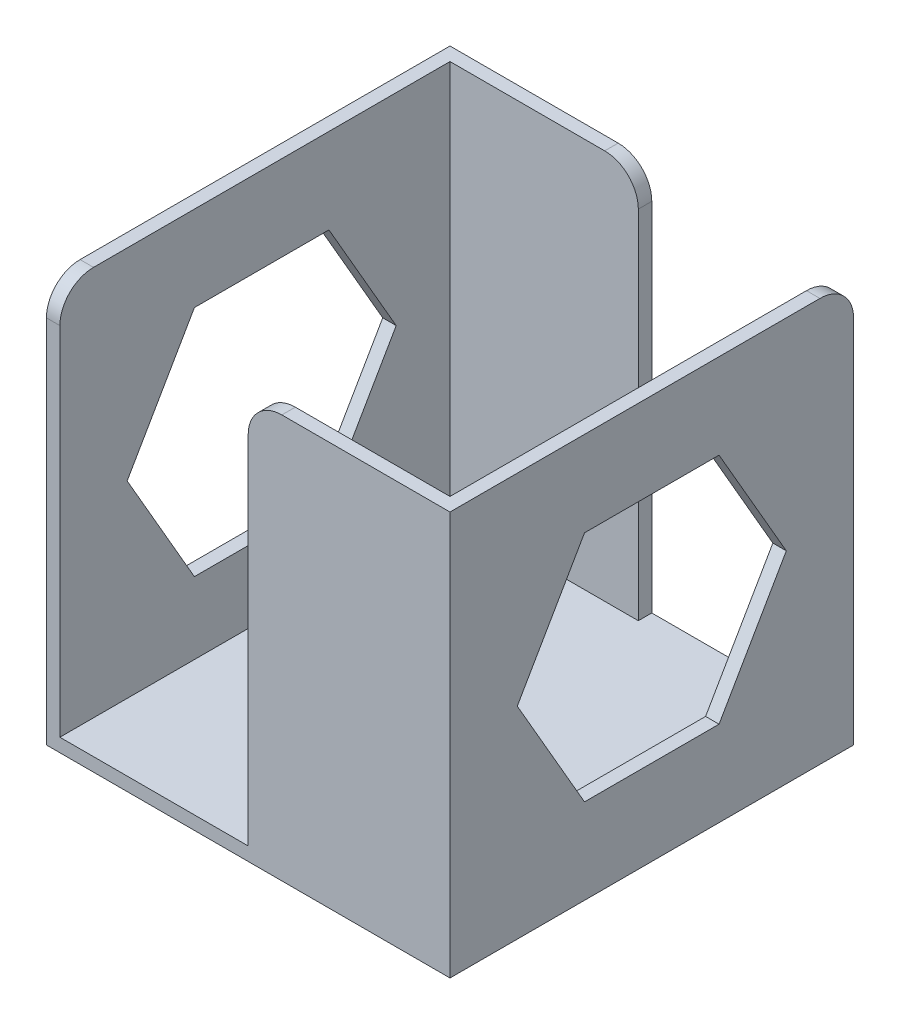
ISO-10303-21;
HEADER;
FILE_DESCRIPTION(('STEP AP214'),'2;1');
FILE_NAME('part.step','',(''),(''),'','','');
FILE_SCHEMA(('AUTOMOTIVE_DESIGN { 1 0 10303 214 1 1 1 1 }'));
ENDSEC;
DATA;
#1=APPLICATION_CONTEXT('core data for automotive mechanical design processes');
#2=APPLICATION_PROTOCOL_DEFINITION('international standard','automotive_design',2000,#1);
#3=PRODUCT_CONTEXT('',#1,'mechanical');
#4=PRODUCT('Part','Part','',(#3));
#5=PRODUCT_RELATED_PRODUCT_CATEGORY('part','',(#4));
#6=PRODUCT_DEFINITION_FORMATION('','',#4);
#7=PRODUCT_DEFINITION_CONTEXT('part definition',#1,'design');
#8=PRODUCT_DEFINITION('design','',#6,#7);
#9=PRODUCT_DEFINITION_SHAPE('','',#8);
#10=(LENGTH_UNIT() NAMED_UNIT(*) SI_UNIT(.MILLI.,.METRE.));
#11=(NAMED_UNIT(*) PLANE_ANGLE_UNIT() SI_UNIT($,.RADIAN.));
#12=(NAMED_UNIT(*) SI_UNIT($,.STERADIAN.) SOLID_ANGLE_UNIT());
#13=UNCERTAINTY_MEASURE_WITH_UNIT(LENGTH_MEASURE(1.E-05),#10,'distance_accuracy_value','');
#14=(GEOMETRIC_REPRESENTATION_CONTEXT(3) GLOBAL_UNCERTAINTY_ASSIGNED_CONTEXT((#13)) GLOBAL_UNIT_ASSIGNED_CONTEXT((#10,
#11,#12)) REPRESENTATION_CONTEXT('',''));
#15=CARTESIAN_POINT('',(0.,0.,0.));
#16=DIRECTION('',(0.,0.,1.));
#17=DIRECTION('',(1.,0.,0.));
#18=AXIS2_PLACEMENT_3D('',#15,#16,#17);
#19=CARTESIAN_POINT('',(30.,60.,30.));
#20=DIRECTION('',(0.,1.,0.));
#21=DIRECTION('',(0.,0.,1.));
#22=AXIS2_PLACEMENT_3D('',#19,#20,#21);
#23=PLANE('',#22);
#24=DIRECTION('',(0.,0.,-1.));
#25=VECTOR('',#24,1.);
#26=CARTESIAN_POINT('',(30.,60.,-30.));
#27=LINE('',#26,#25);
#28=CARTESIAN_POINT('',(30.,60.,30.));
#29=VERTEX_POINT('',#28);
#30=CARTESIAN_POINT('',(30.,60.,-25.));
#31=VERTEX_POINT('',#30);
#32=EDGE_CURVE('E353',#29,#31,#27,.T.);
#33=ORIENTED_EDGE('',*,*,#32,.T.);
#34=DIRECTION('',(-1.,0.,0.));
#35=VECTOR('',#34,1.);
#36=CARTESIAN_POINT('',(28.,60.,-25.));
#37=LINE('',#36,#35);
#38=CARTESIAN_POINT('',(28.,60.,-25.));
#39=VERTEX_POINT('',#38);
#40=EDGE_CURVE('E396',#31,#39,#37,.T.);
#41=ORIENTED_EDGE('',*,*,#40,.T.);
#42=DIRECTION('',(0.,0.,-1.));
#43=VECTOR('',#42,1.);
#44=CARTESIAN_POINT('',(28.,60.,-30.));
#45=LINE('',#44,#43);
#46=CARTESIAN_POINT('',(28.,60.,28.));
#47=VERTEX_POINT('',#46);
#48=EDGE_CURVE('E344',#47,#39,#45,.T.);
#49=ORIENTED_EDGE('',*,*,#48,.F.);
#50=DIRECTION('',(1.,0.,0.));
#51=VECTOR('',#50,1.);
#52=CARTESIAN_POINT('',(-30.,60.,28.));
#53=LINE('',#52,#51);
#54=CARTESIAN_POINT('',(5.,60.,28.));
#55=VERTEX_POINT('',#54);
#56=EDGE_CURVE('E334',#55,#47,#53,.T.);
#57=ORIENTED_EDGE('',*,*,#56,.F.);
#58=DIRECTION('',(0.,0.,1.));
#59=VECTOR('',#58,1.);
#60=CARTESIAN_POINT('',(4.99999999999999,60.,30.));
#61=LINE('',#60,#59);
#62=CARTESIAN_POINT('',(5.,60.,30.));
#63=VERTEX_POINT('',#62);
#64=EDGE_CURVE('E393',#55,#63,#61,.T.);
#65=ORIENTED_EDGE('',*,*,#64,.T.);
#66=DIRECTION('',(1.,0.,0.));
#67=VECTOR('',#66,1.);
#68=CARTESIAN_POINT('',(-30.,60.,30.));
#69=LINE('',#68,#67);
#70=EDGE_CURVE('E362',#63,#29,#69,.T.);
#71=ORIENTED_EDGE('',*,*,#70,.T.);
#72=EDGE_LOOP('',(#33,#41,#49,#57,#65,#71));
#73=FACE_BOUND('',#72,.T.);
#74=ADVANCED_FACE('F31',(#73),#23,.T.);
#75=CARTESIAN_POINT('',(30.,60.,-30.));
#76=DIRECTION('',(-1.,0.,0.));
#77=DIRECTION('',(0.,0.,1.));
#78=AXIS2_PLACEMENT_3D('',#75,#76,#77);
#79=PLANE('',#78);
#80=DIRECTION('',(0.,0.866025403784439,0.5));
#81=VECTOR('',#80,1.);
#82=CARTESIAN_POINT('',(30.,30.,-20.));
#83=LINE('',#82,#81);
#84=CARTESIAN_POINT('',(30.,30.,-20.));
#85=VERTEX_POINT('',#84);
#86=CARTESIAN_POINT('',(30.,47.3205080756888,-10.));
#87=VERTEX_POINT('',#86);
#88=EDGE_CURVE('E262',#85,#87,#83,.T.);
#89=ORIENTED_EDGE('',*,*,#88,.F.);
#90=DIRECTION('',(0.,0.866025403784439,-0.5));
#91=VECTOR('',#90,1.);
#92=CARTESIAN_POINT('',(30.,12.6794919243112,-10.));
#93=LINE('',#92,#91);
#94=CARTESIAN_POINT('',(30.,12.6794919243112,-10.));
#95=VERTEX_POINT('',#94);
#96=EDGE_CURVE('E260',#95,#85,#93,.T.);
#97=ORIENTED_EDGE('',*,*,#96,.F.);
#98=DIRECTION('',(0.,0.,-1.));
#99=VECTOR('',#98,1.);
#100=CARTESIAN_POINT('',(30.,12.6794919243112,10.));
#101=LINE('',#100,#99);
#102=CARTESIAN_POINT('',(30.,12.6794919243112,10.));
#103=VERTEX_POINT('',#102);
#104=EDGE_CURVE('E247',#103,#95,#101,.T.);
#105=ORIENTED_EDGE('',*,*,#104,.F.);
#106=DIRECTION('',(0.,-0.866025403784439,-0.5));
#107=VECTOR('',#106,1.);
#108=CARTESIAN_POINT('',(30.,30.,20.));
#109=LINE('',#108,#107);
#110=CARTESIAN_POINT('',(30.,30.,20.));
#111=VERTEX_POINT('',#110);
#112=EDGE_CURVE('E250',#111,#103,#109,.T.);
#113=ORIENTED_EDGE('',*,*,#112,.F.);
#114=DIRECTION('',(0.,-0.866025403784439,0.5));
#115=VECTOR('',#114,1.);
#116=CARTESIAN_POINT('',(30.,47.3205080756888,10.));
#117=LINE('',#116,#115);
#118=CARTESIAN_POINT('',(30.,47.3205080756888,10.));
#119=VERTEX_POINT('',#118);
#120=EDGE_CURVE('E268',#119,#111,#117,.T.);
#121=ORIENTED_EDGE('',*,*,#120,.F.);
#122=DIRECTION('',(0.,0.,1.));
#123=VECTOR('',#122,1.);
#124=CARTESIAN_POINT('',(30.,47.3205080756888,-10.));
#125=LINE('',#124,#123);
#126=EDGE_CURVE('E265',#87,#119,#125,.T.);
#127=ORIENTED_EDGE('',*,*,#126,.F.);
#128=EDGE_LOOP('',(#89,#97,#105,#113,#121,#127));
#129=FACE_BOUND('',#128,.T.);
#130=DIRECTION('',(0.,-1.,0.));
#131=VECTOR('',#130,1.);
#132=CARTESIAN_POINT('',(30.,60.,-30.));
#133=LINE('',#132,#131);
#134=CARTESIAN_POINT('',(30.,55.,-30.));
#135=VERTEX_POINT('',#134);
#136=CARTESIAN_POINT('',(30.,0.,-30.));
#137=VERTEX_POINT('',#136);
#138=EDGE_CURVE('E380',#135,#137,#133,.T.);
#139=ORIENTED_EDGE('',*,*,#138,.F.);
#140=CARTESIAN_POINT('',(30.,55.,-25.));
#141=DIRECTION('',(-1.,0.,0.));
#142=DIRECTION('',(0.,0.,1.));
#143=AXIS2_PLACEMENT_3D('',#140,#141,#142);
#144=CIRCLE('',#143,5.);
#145=EDGE_CURVE('E405',#135,#31,#144,.F.);
#146=ORIENTED_EDGE('',*,*,#145,.T.);
#147=ORIENTED_EDGE('',*,*,#32,.F.);
#148=DIRECTION('',(0.,-1.,0.));
#149=VECTOR('',#148,1.);
#150=CARTESIAN_POINT('',(30.,60.,30.));
#151=LINE('',#150,#149);
#152=CARTESIAN_POINT('',(30.,0.,30.));
#153=VERTEX_POINT('',#152);
#154=EDGE_CURVE('E364',#29,#153,#151,.T.);
#155=ORIENTED_EDGE('',*,*,#154,.T.);
#156=DIRECTION('',(0.,0.,-1.));
#157=VECTOR('',#156,1.);
#158=CARTESIAN_POINT('',(30.,0.,-30.));
#159=LINE('',#158,#157);
#160=EDGE_CURVE('E339',#153,#137,#159,.T.);
#161=ORIENTED_EDGE('',*,*,#160,.T.);
#162=EDGE_LOOP('',(#139,#146,#147,#155,#161));
#163=FACE_BOUND('',#162,.T.);
#164=ADVANCED_FACE('F454',(#129,#163),#79,.F.);
#165=CARTESIAN_POINT('',(-30.,60.,-30.));
#166=DIRECTION('',(0.,0.,1.));
#167=DIRECTION('',(1.,0.,0.));
#168=AXIS2_PLACEMENT_3D('',#165,#166,#167);
#169=PLANE('',#168);
#170=DIRECTION('',(0.,-1.,0.));
#171=VECTOR('',#170,1.);
#172=CARTESIAN_POINT('',(28.,2.,-30.));
#173=LINE('',#172,#171);
#174=CARTESIAN_POINT('',(28.,55.,-30.));
#175=VERTEX_POINT('',#174);
#176=CARTESIAN_POINT('',(28.,2.,-30.));
#177=VERTEX_POINT('',#176);
#178=EDGE_CURVE('E310',#175,#177,#173,.T.);
#179=ORIENTED_EDGE('',*,*,#178,.F.);
#180=DIRECTION('',(-1.,0.,0.));
#181=VECTOR('',#180,1.);
#182=CARTESIAN_POINT('',(30.,55.,-30.));
#183=LINE('',#182,#181);
#184=EDGE_CURVE('E403',#175,#135,#183,.F.);
#185=ORIENTED_EDGE('',*,*,#184,.T.);
#186=ORIENTED_EDGE('',*,*,#138,.T.);
#187=DIRECTION('',(-1.,0.,0.));
#188=VECTOR('',#187,1.);
#189=CARTESIAN_POINT('',(-30.,0.,-30.));
#190=LINE('',#189,#188);
#191=CARTESIAN_POINT('',(-30.,0.,-30.));
#192=VERTEX_POINT('',#191);
#193=EDGE_CURVE('E367',#137,#192,#190,.T.);
#194=ORIENTED_EDGE('',*,*,#193,.T.);
#195=DIRECTION('',(0.,-1.,0.));
#196=VECTOR('',#195,1.);
#197=CARTESIAN_POINT('',(-30.,60.,-30.));
#198=LINE('',#197,#196);
#199=CARTESIAN_POINT('',(-30.,60.,-30.));
#200=VERTEX_POINT('',#199);
#201=EDGE_CURVE('E377',#200,#192,#198,.T.);
#202=ORIENTED_EDGE('',*,*,#201,.F.);
#203=DIRECTION('',(-1.,0.,0.));
#204=VECTOR('',#203,1.);
#205=CARTESIAN_POINT('',(-30.,60.,-30.));
#206=LINE('',#205,#204);
#207=CARTESIAN_POINT('',(-5.00000000000001,60.,-30.));
#208=VERTEX_POINT('',#207);
#209=EDGE_CURVE('E356',#208,#200,#206,.T.);
#210=ORIENTED_EDGE('',*,*,#209,.F.);
#211=CARTESIAN_POINT('',(-5.00000000000001,55.,-30.));
#212=DIRECTION('',(0.,0.,1.));
#213=DIRECTION('',(1.,0.,0.));
#214=AXIS2_PLACEMENT_3D('',#211,#212,#213);
#215=CIRCLE('',#214,5.);
#216=CARTESIAN_POINT('',(0.,55.,-30.));
#217=VERTEX_POINT('',#216);
#218=EDGE_CURVE('E401',#208,#217,#215,.F.);
#219=ORIENTED_EDGE('',*,*,#218,.T.);
#220=DIRECTION('',(0.,1.,0.));
#221=VECTOR('',#220,1.);
#222=CARTESIAN_POINT('',(0.,2.,-30.));
#223=LINE('',#222,#221);
#224=CARTESIAN_POINT('',(0.,2.,-30.));
#225=VERTEX_POINT('',#224);
#226=EDGE_CURVE('E303',#225,#217,#223,.T.);
#227=ORIENTED_EDGE('',*,*,#226,.F.);
#228=DIRECTION('',(-1.,0.,0.));
#229=VECTOR('',#228,1.);
#230=CARTESIAN_POINT('',(28.,2.,-30.));
#231=LINE('',#230,#229);
#232=EDGE_CURVE('E307',#177,#225,#231,.T.);
#233=ORIENTED_EDGE('',*,*,#232,.F.);
#234=EDGE_LOOP('',(#179,#185,#186,#194,#202,#210,#219,#227,#233));
#235=FACE_BOUND('',#234,.T.);
#236=ADVANCED_FACE('F443',(#235),#169,.F.);
#237=CARTESIAN_POINT('',(-30.,60.,-30.));
#238=DIRECTION('',(1.,0.,0.));
#239=DIRECTION('',(0.,0.,-1.));
#240=AXIS2_PLACEMENT_3D('',#237,#238,#239);
#241=PLANE('',#240);
#242=DIRECTION('',(0.,0.,-1.));
#243=VECTOR('',#242,1.);
#244=CARTESIAN_POINT('',(-30.,12.6794919243112,10.));
#245=LINE('',#244,#243);
#246=CARTESIAN_POINT('',(-30.,12.6794919243112,10.));
#247=VERTEX_POINT('',#246);
#248=CARTESIAN_POINT('',(-30.,12.6794919243112,-10.));
#249=VERTEX_POINT('',#248);
#250=EDGE_CURVE('E246',#247,#249,#245,.T.);
#251=ORIENTED_EDGE('',*,*,#250,.T.);
#252=DIRECTION('',(0.,0.866025403784439,-0.5));
#253=VECTOR('',#252,1.);
#254=CARTESIAN_POINT('',(-30.,12.6794919243112,-10.));
#255=LINE('',#254,#253);
#256=CARTESIAN_POINT('',(-30.,30.,-20.));
#257=VERTEX_POINT('',#256);
#258=EDGE_CURVE('E223',#249,#257,#255,.T.);
#259=ORIENTED_EDGE('',*,*,#258,.T.);
#260=DIRECTION('',(0.,0.866025403784439,0.5));
#261=VECTOR('',#260,1.);
#262=CARTESIAN_POINT('',(-30.,30.,-20.));
#263=LINE('',#262,#261);
#264=CARTESIAN_POINT('',(-30.,47.3205080756888,-9.99999999999999));
#265=VERTEX_POINT('',#264);
#266=EDGE_CURVE('E234',#257,#265,#263,.T.);
#267=ORIENTED_EDGE('',*,*,#266,.T.);
#268=DIRECTION('',(0.,0.,1.));
#269=VECTOR('',#268,1.);
#270=CARTESIAN_POINT('',(-30.,47.3205080756888,-9.99999999999999));
#271=LINE('',#270,#269);
#272=CARTESIAN_POINT('',(-30.,47.3205080756888,10.));
#273=VERTEX_POINT('',#272);
#274=EDGE_CURVE('E240',#265,#273,#271,.T.);
#275=ORIENTED_EDGE('',*,*,#274,.T.);
#276=DIRECTION('',(0.,-0.866025403784439,0.5));
#277=VECTOR('',#276,1.);
#278=CARTESIAN_POINT('',(-30.,47.3205080756888,10.));
#279=LINE('',#278,#277);
#280=CARTESIAN_POINT('',(-30.,30.,20.));
#281=VERTEX_POINT('',#280);
#282=EDGE_CURVE('E254',#273,#281,#279,.T.);
#283=ORIENTED_EDGE('',*,*,#282,.T.);
#284=DIRECTION('',(0.,-0.866025403784439,-0.5));
#285=VECTOR('',#284,1.);
#286=CARTESIAN_POINT('',(-30.,30.,20.));
#287=LINE('',#286,#285);
#288=EDGE_CURVE('E257',#281,#247,#287,.T.);
#289=ORIENTED_EDGE('',*,*,#288,.T.);
#290=EDGE_LOOP('',(#251,#259,#267,#275,#283,#289));
#291=FACE_BOUND('',#290,.T.);
#292=DIRECTION('',(0.,-1.,0.));
#293=VECTOR('',#292,1.);
#294=CARTESIAN_POINT('',(-30.,60.,30.));
#295=LINE('',#294,#293);
#296=CARTESIAN_POINT('',(-30.,55.,30.));
#297=VERTEX_POINT('',#296);
#298=CARTESIAN_POINT('',(-30.,0.,30.));
#299=VERTEX_POINT('',#298);
#300=EDGE_CURVE('E375',#297,#299,#295,.T.);
#301=ORIENTED_EDGE('',*,*,#300,.F.);
#302=CARTESIAN_POINT('',(-30.,55.,25.));
#303=DIRECTION('',(1.,0.,0.));
#304=DIRECTION('',(0.,0.,-1.));
#305=AXIS2_PLACEMENT_3D('',#302,#303,#304);
#306=CIRCLE('',#305,5.);
#307=CARTESIAN_POINT('',(-30.,60.,25.));
#308=VERTEX_POINT('',#307);
#309=EDGE_CURVE('E11',#297,#308,#306,.F.);
#310=ORIENTED_EDGE('',*,*,#309,.T.);
#311=DIRECTION('',(0.,0.,1.));
#312=VECTOR('',#311,1.);
#313=CARTESIAN_POINT('',(-30.,60.,-30.));
#314=LINE('',#313,#312);
#315=EDGE_CURVE('E359',#200,#308,#314,.T.);
#316=ORIENTED_EDGE('',*,*,#315,.F.);
#317=ORIENTED_EDGE('',*,*,#201,.T.);
#318=DIRECTION('',(0.,0.,1.));
#319=VECTOR('',#318,1.);
#320=CARTESIAN_POINT('',(-30.,0.,-30.));
#321=LINE('',#320,#319);
#322=EDGE_CURVE('E369',#192,#299,#321,.T.);
#323=ORIENTED_EDGE('',*,*,#322,.T.);
#324=EDGE_LOOP('',(#301,#310,#316,#317,#323));
#325=FACE_BOUND('',#324,.T.);
#326=ADVANCED_FACE('F242',(#291,#325),#241,.F.);
#327=CARTESIAN_POINT('',(-30.,60.,30.));
#328=DIRECTION('',(0.,0.,-1.));
#329=DIRECTION('',(-1.,0.,0.));
#330=AXIS2_PLACEMENT_3D('',#327,#328,#329);
#331=PLANE('',#330);
#332=ORIENTED_EDGE('',*,*,#70,.F.);
#333=CARTESIAN_POINT('',(4.99999999999999,55.,30.));
#334=DIRECTION('',(0.,0.,-1.));
#335=DIRECTION('',(-1.,0.,0.));
#336=AXIS2_PLACEMENT_3D('',#333,#334,#335);
#337=CIRCLE('',#336,5.);
#338=CARTESIAN_POINT('',(0.,55.,30.));
#339=VERTEX_POINT('',#338);
#340=EDGE_CURVE('E418',#63,#339,#337,.F.);
#341=ORIENTED_EDGE('',*,*,#340,.T.);
#342=DIRECTION('',(0.,1.,0.));
#343=VECTOR('',#342,1.);
#344=CARTESIAN_POINT('',(0.,60.,30.));
#345=LINE('',#344,#343);
#346=CARTESIAN_POINT('',(0.,2.,30.));
#347=VERTEX_POINT('',#346);
#348=EDGE_CURVE('E316',#347,#339,#345,.T.);
#349=ORIENTED_EDGE('',*,*,#348,.F.);
#350=DIRECTION('',(1.,0.,0.));
#351=VECTOR('',#350,1.);
#352=CARTESIAN_POINT('',(-28.,2.,30.));
#353=LINE('',#352,#351);
#354=CARTESIAN_POINT('',(-28.,2.,30.));
#355=VERTEX_POINT('',#354);
#356=EDGE_CURVE('E319',#355,#347,#353,.T.);
#357=ORIENTED_EDGE('',*,*,#356,.F.);
#358=DIRECTION('',(0.,-1.,0.));
#359=VECTOR('',#358,1.);
#360=CARTESIAN_POINT('',(-28.,60.,30.));
#361=LINE('',#360,#359);
#362=CARTESIAN_POINT('',(-28.,55.,30.));
#363=VERTEX_POINT('',#362);
#364=EDGE_CURVE('E306',#363,#355,#361,.T.);
#365=ORIENTED_EDGE('',*,*,#364,.F.);
#366=DIRECTION('',(1.,0.,0.));
#367=VECTOR('',#366,1.);
#368=CARTESIAN_POINT('',(-30.,55.,30.));
#369=LINE('',#368,#367);
#370=EDGE_CURVE('E54',#363,#297,#369,.F.);
#371=ORIENTED_EDGE('',*,*,#370,.T.);
#372=ORIENTED_EDGE('',*,*,#300,.T.);
#373=DIRECTION('',(1.,0.,0.));
#374=VECTOR('',#373,1.);
#375=CARTESIAN_POINT('',(-30.,0.,30.));
#376=LINE('',#375,#374);
#377=EDGE_CURVE('E357',#299,#153,#376,.T.);
#378=ORIENTED_EDGE('',*,*,#377,.T.);
#379=ORIENTED_EDGE('',*,*,#154,.F.);
#380=EDGE_LOOP('',(#332,#341,#349,#357,#365,#371,#372,#378,#379));
#381=FACE_BOUND('',#380,.T.);
#382=ADVANCED_FACE('F431',(#381),#331,.F.);
#383=DIRECTION('',(-1.,0.,0.));
#384=VECTOR('',#383,1.);
#385=CARTESIAN_POINT('',(-30.,60.,-28.));
#386=LINE('',#385,#384);
#387=CARTESIAN_POINT('',(-5.00000000000001,60.,-28.));
#388=VERTEX_POINT('',#387);
#389=CARTESIAN_POINT('',(-28.,60.,-28.));
#390=VERTEX_POINT('',#389);
#391=EDGE_CURVE('E347',#388,#390,#386,.T.);
#392=ORIENTED_EDGE('',*,*,#391,.F.);
#393=DIRECTION('',(0.,0.,-1.));
#394=VECTOR('',#393,1.);
#395=CARTESIAN_POINT('',(-5.00000000000001,60.,-30.));
#396=LINE('',#395,#394);
#397=EDGE_CURVE('E410',#388,#208,#396,.T.);
#398=ORIENTED_EDGE('',*,*,#397,.T.);
#399=ORIENTED_EDGE('',*,*,#209,.T.);
#400=ORIENTED_EDGE('',*,*,#315,.T.);
#401=DIRECTION('',(1.,0.,0.));
#402=VECTOR('',#401,1.);
#403=CARTESIAN_POINT('',(-28.,60.,25.));
#404=LINE('',#403,#402);
#405=CARTESIAN_POINT('',(-28.,60.,25.));
#406=VERTEX_POINT('',#405);
#407=EDGE_CURVE('E407',#308,#406,#404,.T.);
#408=ORIENTED_EDGE('',*,*,#407,.T.);
#409=DIRECTION('',(0.,0.,1.));
#410=VECTOR('',#409,1.);
#411=CARTESIAN_POINT('',(-28.,60.,-30.));
#412=LINE('',#411,#410);
#413=EDGE_CURVE('E349',#390,#406,#412,.T.);
#414=ORIENTED_EDGE('',*,*,#413,.F.);
#415=EDGE_LOOP('',(#392,#398,#399,#400,#408,#414));
#416=FACE_BOUND('',#415,.T.);
#417=ADVANCED_FACE('F437',(#416),#23,.T.);
#418=CARTESIAN_POINT('',(30.,0.,30.));
#419=DIRECTION('',(0.,1.,0.));
#420=DIRECTION('',(0.,0.,1.));
#421=AXIS2_PLACEMENT_3D('',#418,#419,#420);
#422=PLANE('',#421);
#423=ORIENTED_EDGE('',*,*,#160,.F.);
#424=ORIENTED_EDGE('',*,*,#377,.F.);
#425=ORIENTED_EDGE('',*,*,#322,.F.);
#426=ORIENTED_EDGE('',*,*,#193,.F.);
#427=EDGE_LOOP('',(#423,#424,#425,#426));
#428=FACE_BOUND('',#427,.T.);
#429=ADVANCED_FACE('F449',(#428),#422,.F.);
#430=CARTESIAN_POINT('',(28.,60.,-30.));
#431=DIRECTION('',(-1.,0.,0.));
#432=DIRECTION('',(0.,0.,1.));
#433=AXIS2_PLACEMENT_3D('',#430,#431,#432);
#434=PLANE('',#433);
#435=DIRECTION('',(0.,-0.866025403784439,0.5));
#436=VECTOR('',#435,1.);
#437=CARTESIAN_POINT('',(28.,56.8301270189222,-35.4903810567666));
#438=LINE('',#437,#436);
#439=CARTESIAN_POINT('',(28.,30.,-20.));
#440=VERTEX_POINT('',#439);
#441=CARTESIAN_POINT('',(28.,12.6794919243112,-10.));
#442=VERTEX_POINT('',#441);
#443=EDGE_CURVE('E300',#440,#442,#438,.T.);
#444=ORIENTED_EDGE('',*,*,#443,.F.);
#445=DIRECTION('',(0.,-0.866025403784439,-0.5));
#446=VECTOR('',#445,1.);
#447=CARTESIAN_POINT('',(28.,48.1698729810778,-9.50961894323342));
#448=LINE('',#447,#446);
#449=CARTESIAN_POINT('',(28.,47.3205080756888,-10.));
#450=VERTEX_POINT('',#449);
#451=EDGE_CURVE('E275',#450,#440,#448,.T.);
#452=ORIENTED_EDGE('',*,*,#451,.F.);
#453=DIRECTION('',(0.,0.,-1.));
#454=VECTOR('',#453,1.);
#455=CARTESIAN_POINT('',(28.,47.3205080756888,-30.));
#456=LINE('',#455,#454);
#457=CARTESIAN_POINT('',(28.,47.3205080756888,10.));
#458=VERTEX_POINT('',#457);
#459=EDGE_CURVE('E291',#458,#450,#456,.T.);
#460=ORIENTED_EDGE('',*,*,#459,.F.);
#461=DIRECTION('',(0.,0.866025403784439,-0.5));
#462=VECTOR('',#461,1.);
#463=CARTESIAN_POINT('',(28.,74.150635094611,-5.49038105676657));
#464=LINE('',#463,#462);
#465=CARTESIAN_POINT('',(28.,30.,20.));
#466=VERTEX_POINT('',#465);
#467=EDGE_CURVE('E294',#466,#458,#464,.T.);
#468=ORIENTED_EDGE('',*,*,#467,.F.);
#469=DIRECTION('',(0.,0.866025403784439,0.5));
#470=VECTOR('',#469,1.);
#471=CARTESIAN_POINT('',(28.,30.849364905389,20.4903810567666));
#472=LINE('',#471,#470);
#473=CARTESIAN_POINT('',(28.,12.6794919243112,10.));
#474=VERTEX_POINT('',#473);
#475=EDGE_CURVE('E296',#474,#466,#472,.T.);
#476=ORIENTED_EDGE('',*,*,#475,.F.);
#477=DIRECTION('',(0.,0.,1.));
#478=VECTOR('',#477,1.);
#479=CARTESIAN_POINT('',(28.,12.6794919243112,-30.));
#480=LINE('',#479,#478);
#481=EDGE_CURVE('E298',#442,#474,#480,.T.);
#482=ORIENTED_EDGE('',*,*,#481,.F.);
#483=EDGE_LOOP('',(#444,#452,#460,#468,#476,#482));
#484=FACE_BOUND('',#483,.T.);
#485=ORIENTED_EDGE('',*,*,#48,.T.);
#486=CARTESIAN_POINT('',(28.,55.,-25.));
#487=DIRECTION('',(-1.,0.,0.));
#488=DIRECTION('',(0.,0.,1.));
#489=AXIS2_PLACEMENT_3D('',#486,#487,#488);
#490=CIRCLE('',#489,5.);
#491=EDGE_CURVE('E399',#39,#175,#490,.T.);
#492=ORIENTED_EDGE('',*,*,#491,.T.);
#493=ORIENTED_EDGE('',*,*,#178,.T.);
#494=DIRECTION('',(0.,0.,-1.));
#495=VECTOR('',#494,1.);
#496=CARTESIAN_POINT('',(28.,2.,-30.));
#497=LINE('',#496,#495);
#498=CARTESIAN_POINT('',(28.,2.,28.));
#499=VERTEX_POINT('',#498);
#500=EDGE_CURVE('E325',#499,#177,#497,.T.);
#501=ORIENTED_EDGE('',*,*,#500,.F.);
#502=DIRECTION('',(0.,-1.,0.));
#503=VECTOR('',#502,1.);
#504=CARTESIAN_POINT('',(28.,60.,28.));
#505=LINE('',#504,#503);
#506=EDGE_CURVE('E330',#47,#499,#505,.T.);
#507=ORIENTED_EDGE('',*,*,#506,.F.);
#508=EDGE_LOOP('',(#485,#492,#493,#501,#507));
#509=FACE_BOUND('',#508,.T.);
#510=ADVANCED_FACE('F463',(#484,#509),#434,.T.);
#511=CARTESIAN_POINT('',(-30.,60.,-28.));
#512=DIRECTION('',(0.,0.,1.));
#513=DIRECTION('',(1.,0.,0.));
#514=AXIS2_PLACEMENT_3D('',#511,#512,#513);
#515=PLANE('',#514);
#516=DIRECTION('',(0.,1.,0.));
#517=VECTOR('',#516,1.);
#518=CARTESIAN_POINT('',(0.,2.,-28.));
#519=LINE('',#518,#517);
#520=CARTESIAN_POINT('',(0.,2.,-28.));
#521=VERTEX_POINT('',#520);
#522=CARTESIAN_POINT('',(0.,55.,-28.));
#523=VERTEX_POINT('',#522);
#524=EDGE_CURVE('E302',#521,#523,#519,.T.);
#525=ORIENTED_EDGE('',*,*,#524,.T.);
#526=CARTESIAN_POINT('',(-5.00000000000001,55.,-28.));
#527=DIRECTION('',(0.,0.,1.));
#528=DIRECTION('',(1.,0.,0.));
#529=AXIS2_PLACEMENT_3D('',#526,#527,#528);
#530=CIRCLE('',#529,5.);
#531=EDGE_CURVE('E415',#523,#388,#530,.T.);
#532=ORIENTED_EDGE('',*,*,#531,.T.);
#533=ORIENTED_EDGE('',*,*,#391,.T.);
#534=DIRECTION('',(0.,-1.,0.));
#535=VECTOR('',#534,1.);
#536=CARTESIAN_POINT('',(-28.,60.,-28.));
#537=LINE('',#536,#535);
#538=CARTESIAN_POINT('',(-28.,2.,-28.));
#539=VERTEX_POINT('',#538);
#540=EDGE_CURVE('E333',#390,#539,#537,.T.);
#541=ORIENTED_EDGE('',*,*,#540,.T.);
#542=DIRECTION('',(-1.,0.,0.));
#543=VECTOR('',#542,1.);
#544=CARTESIAN_POINT('',(-30.,2.,-28.));
#545=LINE('',#544,#543);
#546=EDGE_CURVE('E329',#521,#539,#545,.T.);
#547=ORIENTED_EDGE('',*,*,#546,.F.);
#548=EDGE_LOOP('',(#525,#532,#533,#541,#547));
#549=FACE_BOUND('',#548,.T.);
#550=ADVANCED_FACE('F487',(#549),#515,.T.);
#551=CARTESIAN_POINT('',(-28.,60.,-30.));
#552=DIRECTION('',(1.,0.,0.));
#553=DIRECTION('',(0.,0.,-1.));
#554=AXIS2_PLACEMENT_3D('',#551,#552,#553);
#555=PLANE('',#554);
#556=DIRECTION('',(0.,0.866025403784439,-0.5));
#557=VECTOR('',#556,1.);
#558=CARTESIAN_POINT('',(-28.,56.8301270189222,-35.4903810567666));
#559=LINE('',#558,#557);
#560=CARTESIAN_POINT('',(-28.,12.6794919243112,-10.));
#561=VERTEX_POINT('',#560);
#562=CARTESIAN_POINT('',(-28.,30.,-20.));
#563=VERTEX_POINT('',#562);
#564=EDGE_CURVE('E226',#561,#563,#559,.T.);
#565=ORIENTED_EDGE('',*,*,#564,.F.);
#566=DIRECTION('',(0.,0.,-1.));
#567=VECTOR('',#566,1.);
#568=CARTESIAN_POINT('',(-28.,12.6794919243112,-30.));
#569=LINE('',#568,#567);
#570=CARTESIAN_POINT('',(-28.,12.6794919243112,10.));
#571=VERTEX_POINT('',#570);
#572=EDGE_CURVE('E390',#571,#561,#569,.T.);
#573=ORIENTED_EDGE('',*,*,#572,.F.);
#574=DIRECTION('',(0.,-0.866025403784439,-0.5));
#575=VECTOR('',#574,1.);
#576=CARTESIAN_POINT('',(-28.,30.849364905389,20.4903810567666));
#577=LINE('',#576,#575);
#578=CARTESIAN_POINT('',(-28.,30.,20.));
#579=VERTEX_POINT('',#578);
#580=EDGE_CURVE('E388',#579,#571,#577,.T.);
#581=ORIENTED_EDGE('',*,*,#580,.F.);
#582=DIRECTION('',(0.,-0.866025403784439,0.5));
#583=VECTOR('',#582,1.);
#584=CARTESIAN_POINT('',(-28.,74.150635094611,-5.49038105676657));
#585=LINE('',#584,#583);
#586=CARTESIAN_POINT('',(-28.,47.3205080756888,10.));
#587=VERTEX_POINT('',#586);
#588=EDGE_CURVE('E386',#587,#579,#585,.T.);
#589=ORIENTED_EDGE('',*,*,#588,.F.);
#590=DIRECTION('',(0.,0.,1.));
#591=VECTOR('',#590,1.);
#592=CARTESIAN_POINT('',(-28.,47.3205080756888,-30.));
#593=LINE('',#592,#591);
#594=CARTESIAN_POINT('',(-28.,47.3205080756888,-9.99999999999999));
#595=VERTEX_POINT('',#594);
#596=EDGE_CURVE('E384',#595,#587,#593,.T.);
#597=ORIENTED_EDGE('',*,*,#596,.F.);
#598=DIRECTION('',(0.,0.866025403784439,0.5));
#599=VECTOR('',#598,1.);
#600=CARTESIAN_POINT('',(-28.,48.1698729810778,-9.50961894323342));
#601=LINE('',#600,#599);
#602=EDGE_CURVE('E382',#563,#595,#601,.T.);
#603=ORIENTED_EDGE('',*,*,#602,.F.);
#604=EDGE_LOOP('',(#565,#573,#581,#589,#597,#603));
#605=FACE_BOUND('',#604,.T.);
#606=ORIENTED_EDGE('',*,*,#413,.T.);
#607=CARTESIAN_POINT('',(-28.,55.,25.));
#608=DIRECTION('',(1.,0.,0.));
#609=DIRECTION('',(0.,0.,-1.));
#610=AXIS2_PLACEMENT_3D('',#607,#608,#609);
#611=CIRCLE('',#610,5.);
#612=EDGE_CURVE('E39',#406,#363,#611,.T.);
#613=ORIENTED_EDGE('',*,*,#612,.T.);
#614=ORIENTED_EDGE('',*,*,#364,.T.);
#615=DIRECTION('',(0.,0.,1.));
#616=VECTOR('',#615,1.);
#617=CARTESIAN_POINT('',(-28.,2.,-30.));
#618=LINE('',#617,#616);
#619=EDGE_CURVE('E336',#539,#355,#618,.T.);
#620=ORIENTED_EDGE('',*,*,#619,.F.);
#621=ORIENTED_EDGE('',*,*,#540,.F.);
#622=EDGE_LOOP('',(#606,#613,#614,#620,#621));
#623=FACE_BOUND('',#622,.T.);
#624=ADVANCED_FACE('F423',(#605,#623),#555,.T.);
#625=CARTESIAN_POINT('',(-30.,60.,28.));
#626=DIRECTION('',(0.,0.,-1.));
#627=DIRECTION('',(-1.,0.,0.));
#628=AXIS2_PLACEMENT_3D('',#625,#626,#627);
#629=PLANE('',#628);
#630=DIRECTION('',(0.,1.,0.));
#631=VECTOR('',#630,1.);
#632=CARTESIAN_POINT('',(0.,60.,28.));
#633=LINE('',#632,#631);
#634=CARTESIAN_POINT('',(0.,2.,28.));
#635=VERTEX_POINT('',#634);
#636=CARTESIAN_POINT('',(0.,55.,28.));
#637=VERTEX_POINT('',#636);
#638=EDGE_CURVE('E323',#635,#637,#633,.T.);
#639=ORIENTED_EDGE('',*,*,#638,.T.);
#640=CARTESIAN_POINT('',(4.99999999999999,55.,28.));
#641=DIRECTION('',(0.,0.,-1.));
#642=DIRECTION('',(-1.,0.,0.));
#643=AXIS2_PLACEMENT_3D('',#640,#641,#642);
#644=CIRCLE('',#643,5.);
#645=EDGE_CURVE('E421',#637,#55,#644,.T.);
#646=ORIENTED_EDGE('',*,*,#645,.T.);
#647=ORIENTED_EDGE('',*,*,#56,.T.);
#648=ORIENTED_EDGE('',*,*,#506,.T.);
#649=DIRECTION('',(1.,0.,0.));
#650=VECTOR('',#649,1.);
#651=CARTESIAN_POINT('',(-30.,2.,28.));
#652=LINE('',#651,#650);
#653=EDGE_CURVE('E342',#635,#499,#652,.T.);
#654=ORIENTED_EDGE('',*,*,#653,.F.);
#655=EDGE_LOOP('',(#639,#646,#647,#648,#654));
#656=FACE_BOUND('',#655,.T.);
#657=ADVANCED_FACE('F494',(#656),#629,.T.);
#658=CARTESIAN_POINT('',(30.,2.,30.));
#659=DIRECTION('',(0.,1.,0.));
#660=DIRECTION('',(0.,0.,1.));
#661=AXIS2_PLACEMENT_3D('',#658,#659,#660);
#662=PLANE('',#661);
#663=ORIENTED_EDGE('',*,*,#500,.T.);
#664=ORIENTED_EDGE('',*,*,#232,.T.);
#665=DIRECTION('',(0.,0.,-1.));
#666=VECTOR('',#665,1.);
#667=CARTESIAN_POINT('',(0.,2.,30.001));
#668=LINE('',#667,#666);
#669=EDGE_CURVE('E312',#521,#225,#668,.T.);
#670=ORIENTED_EDGE('',*,*,#669,.F.);
#671=ORIENTED_EDGE('',*,*,#546,.T.);
#672=ORIENTED_EDGE('',*,*,#619,.T.);
#673=ORIENTED_EDGE('',*,*,#356,.T.);
#674=DIRECTION('',(0.,0.,1.));
#675=VECTOR('',#674,1.);
#676=CARTESIAN_POINT('',(0.,2.,-36.4049687524185));
#677=LINE('',#676,#675);
#678=EDGE_CURVE('E318',#635,#347,#677,.T.);
#679=ORIENTED_EDGE('',*,*,#678,.F.);
#680=ORIENTED_EDGE('',*,*,#653,.T.);
#681=EDGE_LOOP('',(#663,#664,#670,#671,#672,#673,#679,#680));
#682=FACE_BOUND('',#681,.T.);
#683=ADVANCED_FACE('F469',(#682),#662,.T.);
#684=CARTESIAN_POINT('',(0.,60.,-36.4049687524185));
#685=DIRECTION('',(1.,0.,0.));
#686=DIRECTION('',(0.,0.,-1.));
#687=AXIS2_PLACEMENT_3D('',#684,#685,#686);
#688=PLANE('',#687);
#689=ORIENTED_EDGE('',*,*,#348,.T.);
#690=DIRECTION('',(0.,0.,1.));
#691=VECTOR('',#690,1.);
#692=CARTESIAN_POINT('',(0.,55.,28.));
#693=LINE('',#692,#691);
#694=EDGE_CURVE('E46',#339,#637,#693,.F.);
#695=ORIENTED_EDGE('',*,*,#694,.T.);
#696=ORIENTED_EDGE('',*,*,#638,.F.);
#697=ORIENTED_EDGE('',*,*,#678,.T.);
#698=EDGE_LOOP('',(#689,#695,#696,#697));
#699=FACE_BOUND('',#698,.T.);
#700=ADVANCED_FACE('F478',(#699),#688,.F.);
#701=CARTESIAN_POINT('',(0.,2.,30.001));
#702=DIRECTION('',(-1.,0.,0.));
#703=DIRECTION('',(0.,0.,1.));
#704=AXIS2_PLACEMENT_3D('',#701,#702,#703);
#705=PLANE('',#704);
#706=ORIENTED_EDGE('',*,*,#226,.T.);
#707=DIRECTION('',(0.,0.,-1.));
#708=VECTOR('',#707,1.);
#709=CARTESIAN_POINT('',(0.,55.,-28.));
#710=LINE('',#709,#708);
#711=EDGE_CURVE('E413',#217,#523,#710,.F.);
#712=ORIENTED_EDGE('',*,*,#711,.T.);
#713=ORIENTED_EDGE('',*,*,#524,.F.);
#714=ORIENTED_EDGE('',*,*,#669,.T.);
#715=EDGE_LOOP('',(#706,#712,#713,#714));
#716=FACE_BOUND('',#715,.T.);
#717=ADVANCED_FACE('F486',(#716),#705,.F.);
#718=CARTESIAN_POINT('',(-30.,30.,-20.));
#719=DIRECTION('',(0.,0.5,-0.866025403784439));
#720=DIRECTION('',(0.,0.866025403784439,0.5));
#721=AXIS2_PLACEMENT_3D('',#718,#719,#720);
#722=PLANE('',#721);
#723=ORIENTED_EDGE('',*,*,#602,.T.);
#724=DIRECTION('',(1.,0.,0.));
#725=VECTOR('',#724,1.);
#726=CARTESIAN_POINT('',(-30.,47.3205080756888,-9.99999999999999));
#727=LINE('',#726,#725);
#728=EDGE_CURVE('E237',#265,#595,#727,.T.);
#729=ORIENTED_EDGE('',*,*,#728,.F.);
#730=ORIENTED_EDGE('',*,*,#266,.F.);
#731=DIRECTION('',(1.,0.,0.));
#732=VECTOR('',#731,1.);
#733=CARTESIAN_POINT('',(-30.,30.,-20.));
#734=LINE('',#733,#732);
#735=EDGE_CURVE('E218',#257,#563,#734,.T.);
#736=ORIENTED_EDGE('',*,*,#735,.T.);
#737=EDGE_LOOP('',(#723,#729,#730,#736));
#738=FACE_BOUND('',#737,.T.);
#739=ADVANCED_FACE('F235',(#738),#722,.F.);
#740=CARTESIAN_POINT('',(-30.,47.3205080756888,-9.99999999999999));
#741=DIRECTION('',(0.,1.,0.));
#742=DIRECTION('',(0.,0.,1.));
#743=AXIS2_PLACEMENT_3D('',#740,#741,#742);
#744=PLANE('',#743);
#745=ORIENTED_EDGE('',*,*,#596,.T.);
#746=DIRECTION('',(1.,0.,0.));
#747=VECTOR('',#746,1.);
#748=CARTESIAN_POINT('',(-30.,47.3205080756888,10.));
#749=LINE('',#748,#747);
#750=EDGE_CURVE('E285',#273,#587,#749,.T.);
#751=ORIENTED_EDGE('',*,*,#750,.F.);
#752=ORIENTED_EDGE('',*,*,#274,.F.);
#753=ORIENTED_EDGE('',*,*,#728,.T.);
#754=EDGE_LOOP('',(#745,#751,#752,#753));
#755=FACE_BOUND('',#754,.T.);
#756=ADVANCED_FACE('F648',(#755),#744,.F.);
#757=CARTESIAN_POINT('',(-30.,47.3205080756888,10.));
#758=DIRECTION('',(0.,0.5,0.866025403784439));
#759=DIRECTION('',(0.,-0.866025403784439,0.5));
#760=AXIS2_PLACEMENT_3D('',#757,#758,#759);
#761=PLANE('',#760);
#762=ORIENTED_EDGE('',*,*,#588,.T.);
#763=DIRECTION('',(1.,0.,0.));
#764=VECTOR('',#763,1.);
#765=CARTESIAN_POINT('',(-30.,30.,20.));
#766=LINE('',#765,#764);
#767=EDGE_CURVE('E281',#281,#579,#766,.T.);
#768=ORIENTED_EDGE('',*,*,#767,.F.);
#769=ORIENTED_EDGE('',*,*,#282,.F.);
#770=ORIENTED_EDGE('',*,*,#750,.T.);
#771=EDGE_LOOP('',(#762,#768,#769,#770));
#772=FACE_BOUND('',#771,.T.);
#773=ADVANCED_FACE('F659',(#772),#761,.F.);
#774=CARTESIAN_POINT('',(-30.,30.,20.));
#775=DIRECTION('',(0.,-0.5,0.866025403784438));
#776=DIRECTION('',(0.,-0.866025403784439,-0.5));
#777=AXIS2_PLACEMENT_3D('',#774,#775,#776);
#778=PLANE('',#777);
#779=ORIENTED_EDGE('',*,*,#580,.T.);
#780=DIRECTION('',(1.,0.,0.));
#781=VECTOR('',#780,1.);
#782=CARTESIAN_POINT('',(-30.,12.6794919243112,10.));
#783=LINE('',#782,#781);
#784=EDGE_CURVE('E277',#247,#571,#783,.T.);
#785=ORIENTED_EDGE('',*,*,#784,.F.);
#786=ORIENTED_EDGE('',*,*,#288,.F.);
#787=ORIENTED_EDGE('',*,*,#767,.T.);
#788=EDGE_LOOP('',(#779,#785,#786,#787));
#789=FACE_BOUND('',#788,.T.);
#790=ADVANCED_FACE('F670',(#789),#778,.F.);
#791=CARTESIAN_POINT('',(-30.,12.6794919243112,10.));
#792=DIRECTION('',(0.,-1.,0.));
#793=DIRECTION('',(0.,0.,-1.));
#794=AXIS2_PLACEMENT_3D('',#791,#792,#793);
#795=PLANE('',#794);
#796=ORIENTED_EDGE('',*,*,#572,.T.);
#797=DIRECTION('',(1.,0.,0.));
#798=VECTOR('',#797,1.);
#799=CARTESIAN_POINT('',(-30.,12.6794919243112,-10.));
#800=LINE('',#799,#798);
#801=EDGE_CURVE('E273',#249,#561,#800,.T.);
#802=ORIENTED_EDGE('',*,*,#801,.F.);
#803=ORIENTED_EDGE('',*,*,#250,.F.);
#804=ORIENTED_EDGE('',*,*,#784,.T.);
#805=EDGE_LOOP('',(#796,#802,#803,#804));
#806=FACE_BOUND('',#805,.T.);
#807=ADVANCED_FACE('F681',(#806),#795,.F.);
#808=CARTESIAN_POINT('',(-30.,12.6794919243112,-10.));
#809=DIRECTION('',(0.,-0.499999999999999,-0.866025403784439));
#810=DIRECTION('',(0.,0.866025403784439,-0.5));
#811=AXIS2_PLACEMENT_3D('',#808,#809,#810);
#812=PLANE('',#811);
#813=ORIENTED_EDGE('',*,*,#564,.T.);
#814=ORIENTED_EDGE('',*,*,#735,.F.);
#815=ORIENTED_EDGE('',*,*,#258,.F.);
#816=ORIENTED_EDGE('',*,*,#801,.T.);
#817=EDGE_LOOP('',(#813,#814,#815,#816));
#818=FACE_BOUND('',#817,.T.);
#819=ADVANCED_FACE('F220',(#818),#812,.F.);
#820=ORIENTED_EDGE('',*,*,#443,.T.);
#821=EDGE_CURVE('E276',#442,#95,#800,.T.);
#822=ORIENTED_EDGE('',*,*,#821,.T.);
#823=ORIENTED_EDGE('',*,*,#96,.T.);
#824=EDGE_CURVE('E230',#440,#85,#734,.T.);
#825=ORIENTED_EDGE('',*,*,#824,.F.);
#826=EDGE_LOOP('',(#820,#822,#823,#825));
#827=FACE_BOUND('',#826,.T.);
#828=ADVANCED_FACE('F678',(#827),#812,.F.);
#829=ORIENTED_EDGE('',*,*,#481,.T.);
#830=EDGE_CURVE('E280',#474,#103,#783,.T.);
#831=ORIENTED_EDGE('',*,*,#830,.T.);
#832=ORIENTED_EDGE('',*,*,#104,.T.);
#833=ORIENTED_EDGE('',*,*,#821,.F.);
#834=EDGE_LOOP('',(#829,#831,#832,#833));
#835=FACE_BOUND('',#834,.T.);
#836=ADVANCED_FACE('F667',(#835),#795,.F.);
#837=ORIENTED_EDGE('',*,*,#475,.T.);
#838=EDGE_CURVE('E284',#466,#111,#766,.T.);
#839=ORIENTED_EDGE('',*,*,#838,.T.);
#840=ORIENTED_EDGE('',*,*,#112,.T.);
#841=ORIENTED_EDGE('',*,*,#830,.F.);
#842=EDGE_LOOP('',(#837,#839,#840,#841));
#843=FACE_BOUND('',#842,.T.);
#844=ADVANCED_FACE('F656',(#843),#778,.F.);
#845=ORIENTED_EDGE('',*,*,#467,.T.);
#846=EDGE_CURVE('E288',#458,#119,#749,.T.);
#847=ORIENTED_EDGE('',*,*,#846,.T.);
#848=ORIENTED_EDGE('',*,*,#120,.T.);
#849=ORIENTED_EDGE('',*,*,#838,.F.);
#850=EDGE_LOOP('',(#845,#847,#848,#849));
#851=FACE_BOUND('',#850,.T.);
#852=ADVANCED_FACE('F645',(#851),#761,.F.);
#853=ORIENTED_EDGE('',*,*,#459,.T.);
#854=EDGE_CURVE('E229',#450,#87,#727,.T.);
#855=ORIENTED_EDGE('',*,*,#854,.T.);
#856=ORIENTED_EDGE('',*,*,#126,.T.);
#857=ORIENTED_EDGE('',*,*,#846,.F.);
#858=EDGE_LOOP('',(#853,#855,#856,#857));
#859=FACE_BOUND('',#858,.T.);
#860=ADVANCED_FACE('F635',(#859),#744,.F.);
#861=ORIENTED_EDGE('',*,*,#451,.T.);
#862=ORIENTED_EDGE('',*,*,#824,.T.);
#863=ORIENTED_EDGE('',*,*,#88,.T.);
#864=ORIENTED_EDGE('',*,*,#854,.F.);
#865=EDGE_LOOP('',(#861,#862,#863,#864));
#866=FACE_BOUND('',#865,.T.);
#867=ADVANCED_FACE('F523',(#866),#722,.F.);
#868=CARTESIAN_POINT('',(30.,55.,-25.));
#869=DIRECTION('',(1.,0.,0.));
#870=DIRECTION('',(0.,0.,-1.));
#871=AXIS2_PLACEMENT_3D('',#868,#869,#870);
#872=CYLINDRICAL_SURFACE('',#871,5.);
#873=ORIENTED_EDGE('',*,*,#145,.F.);
#874=ORIENTED_EDGE('',*,*,#184,.F.);
#875=ORIENTED_EDGE('',*,*,#491,.F.);
#876=ORIENTED_EDGE('',*,*,#40,.F.);
#877=EDGE_LOOP('',(#873,#874,#875,#876));
#878=FACE_BOUND('',#877,.T.);
#879=ADVANCED_FACE('F460',(#878),#872,.T.);
#880=CARTESIAN_POINT('',(-5.00000000000001,55.,30.));
#881=DIRECTION('',(0.,0.,1.));
#882=DIRECTION('',(1.,0.,0.));
#883=AXIS2_PLACEMENT_3D('',#880,#881,#882);
#884=CYLINDRICAL_SURFACE('',#883,5.);
#885=ORIENTED_EDGE('',*,*,#531,.F.);
#886=ORIENTED_EDGE('',*,*,#711,.F.);
#887=ORIENTED_EDGE('',*,*,#218,.F.);
#888=ORIENTED_EDGE('',*,*,#397,.F.);
#889=EDGE_LOOP('',(#885,#886,#887,#888));
#890=FACE_BOUND('',#889,.T.);
#891=ADVANCED_FACE('F483',(#890),#884,.T.);
#892=CARTESIAN_POINT('',(4.99999999999999,55.,30.));
#893=DIRECTION('',(0.,0.,-1.));
#894=DIRECTION('',(-1.,0.,0.));
#895=AXIS2_PLACEMENT_3D('',#892,#893,#894);
#896=CYLINDRICAL_SURFACE('',#895,5.);
#897=ORIENTED_EDGE('',*,*,#645,.F.);
#898=ORIENTED_EDGE('',*,*,#694,.F.);
#899=ORIENTED_EDGE('',*,*,#340,.F.);
#900=ORIENTED_EDGE('',*,*,#64,.F.);
#901=EDGE_LOOP('',(#897,#898,#899,#900));
#902=FACE_BOUND('',#901,.T.);
#903=ADVANCED_FACE('F477',(#902),#896,.T.);
#904=CARTESIAN_POINT('',(30.,55.,25.));
#905=DIRECTION('',(-1.,0.,0.));
#906=DIRECTION('',(0.,0.,1.));
#907=AXIS2_PLACEMENT_3D('',#904,#905,#906);
#908=CYLINDRICAL_SURFACE('',#907,5.);
#909=ORIENTED_EDGE('',*,*,#309,.F.);
#910=ORIENTED_EDGE('',*,*,#370,.F.);
#911=ORIENTED_EDGE('',*,*,#612,.F.);
#912=ORIENTED_EDGE('',*,*,#407,.F.);
#913=EDGE_LOOP('',(#909,#910,#911,#912));
#914=FACE_BOUND('',#913,.T.);
#915=ADVANCED_FACE('F33',(#914),#908,.T.);
#916=CLOSED_SHELL('',(#74,#164,#236,#326,#382,#417,#429,#510,#550,#624,#657,#683,#700,#717,#739,
#756,#773,#790,#807,#819,#828,#836,#844,#852,#860,#867,#879,#891,#903,#915));
#917=MANIFOLD_SOLID_BREP('B2',#916);
#918=ADVANCED_BREP_SHAPE_REPRESENTATION('',(#18,#917),#14);
#919=SHAPE_DEFINITION_REPRESENTATION(#9,#918);
ENDSEC;
END-ISO-10303-21;
